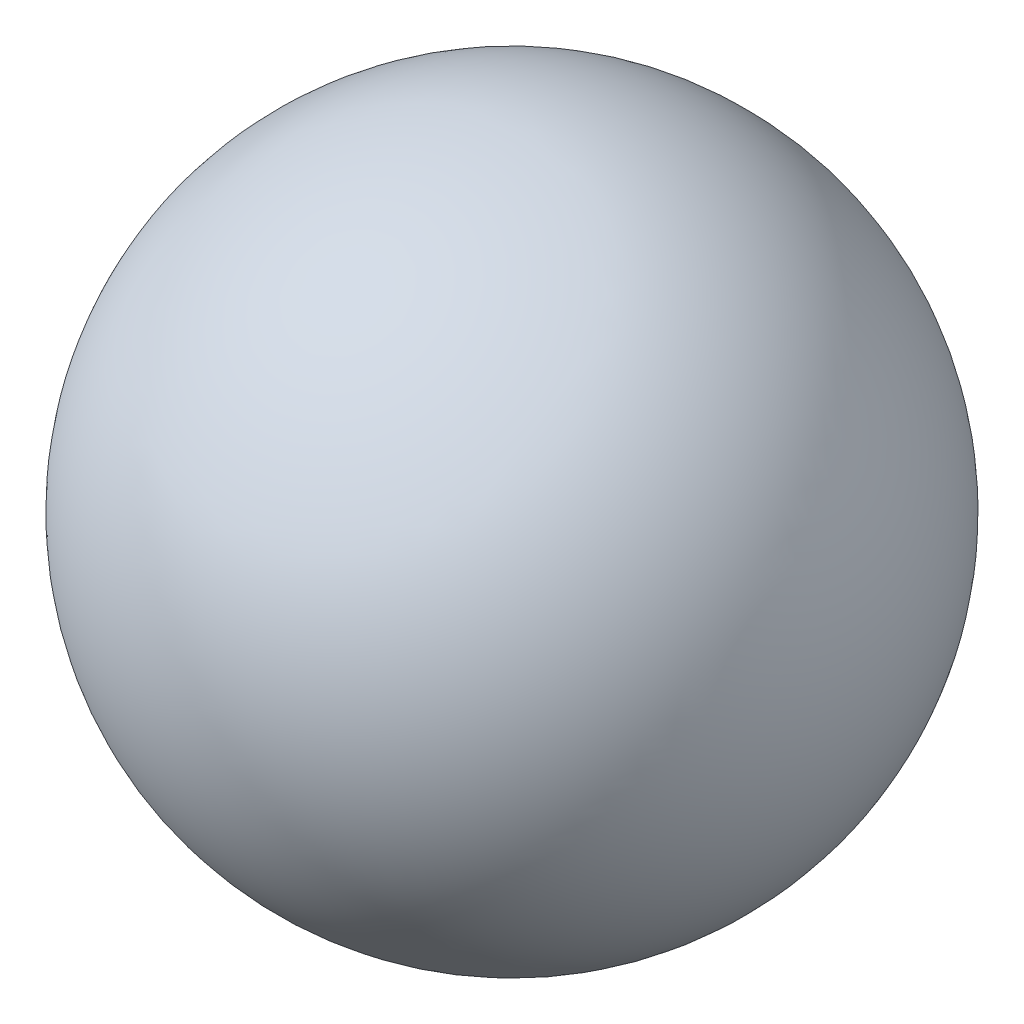
ISO-10303-21;
HEADER;
FILE_DESCRIPTION(('STEP AP214'),'2;1');
FILE_NAME('part.step','',(''),(''),'','','');
FILE_SCHEMA(('AUTOMOTIVE_DESIGN { 1 0 10303 214 1 1 1 1 }'));
ENDSEC;
DATA;
#1=APPLICATION_CONTEXT('core data for automotive mechanical design processes');
#2=APPLICATION_PROTOCOL_DEFINITION('international standard','automotive_design',2000,#1);
#3=PRODUCT_CONTEXT('',#1,'mechanical');
#4=PRODUCT('Part','Part','',(#3));
#5=PRODUCT_RELATED_PRODUCT_CATEGORY('part','',(#4));
#6=PRODUCT_DEFINITION_FORMATION('','',#4);
#7=PRODUCT_DEFINITION_CONTEXT('part definition',#1,'design');
#8=PRODUCT_DEFINITION('design','',#6,#7);
#9=PRODUCT_DEFINITION_SHAPE('','',#8);
#10=(LENGTH_UNIT() NAMED_UNIT(*) SI_UNIT(.MILLI.,.METRE.));
#11=(NAMED_UNIT(*) PLANE_ANGLE_UNIT() SI_UNIT($,.RADIAN.));
#12=(NAMED_UNIT(*) SI_UNIT($,.STERADIAN.) SOLID_ANGLE_UNIT());
#13=UNCERTAINTY_MEASURE_WITH_UNIT(LENGTH_MEASURE(1.E-05),#10,'distance_accuracy_value','');
#14=(GEOMETRIC_REPRESENTATION_CONTEXT(3) GLOBAL_UNCERTAINTY_ASSIGNED_CONTEXT((#13)) GLOBAL_UNIT_ASSIGNED_CONTEXT((#10,
#11,#12)) REPRESENTATION_CONTEXT('',''));
#15=CARTESIAN_POINT('',(0.,0.,0.));
#16=DIRECTION('',(0.,0.,1.));
#17=DIRECTION('',(1.,0.,0.));
#18=AXIS2_PLACEMENT_3D('',#15,#16,#17);
#19=CARTESIAN_POINT('',(0.,0.,0.));
#20=DIRECTION('',(-1.,0.,0.));
#21=DIRECTION('',(0.,1.,0.));
#22=AXIS2_PLACEMENT_3D('',#19,#20,#21);
#23=SPHERICAL_SURFACE('',#22,19.);
#24=CARTESIAN_POINT('',(-19.,0.,0.));
#25=VERTEX_POINT('',#24);
#26=VERTEX_LOOP('',#25);
#27=FACE_BOUND('',#26,.T.);
#28=ADVANCED_FACE('F33',(#27),#23,.T.);
#29=CLOSED_SHELL('',(#28));
#30=MANIFOLD_SOLID_BREP('B2',#29);
#31=ADVANCED_BREP_SHAPE_REPRESENTATION('',(#18,#30),#14);
#32=SHAPE_DEFINITION_REPRESENTATION(#9,#31);
ENDSEC;
END-ISO-10303-21;
